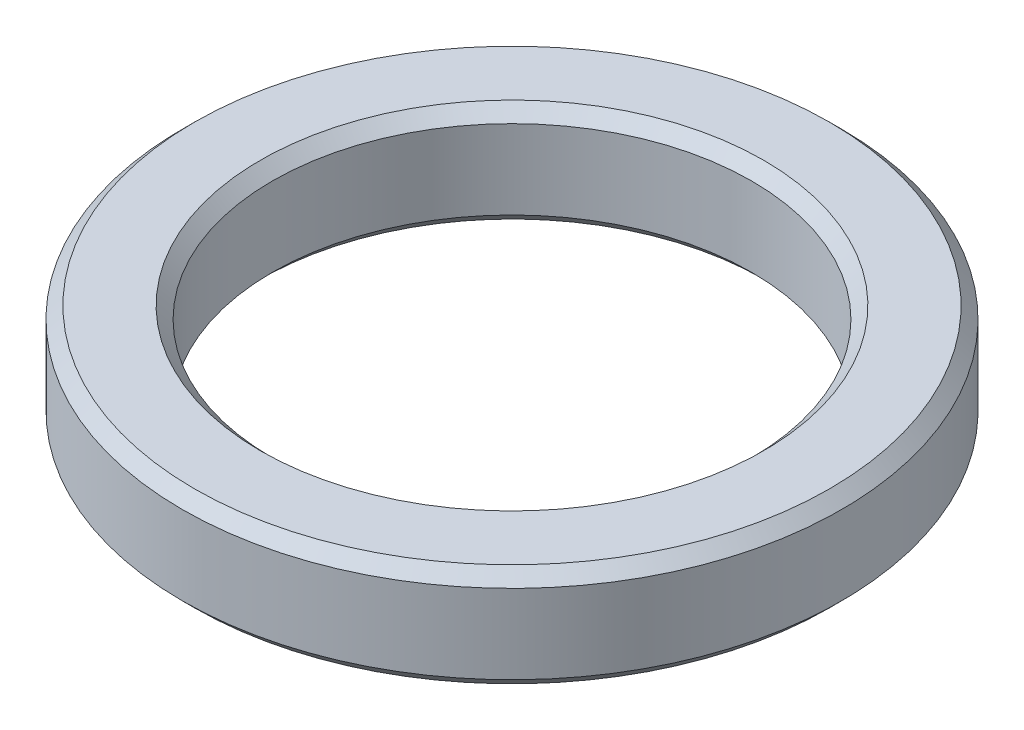
ISO-10303-21;
HEADER;
FILE_DESCRIPTION(('STEP AP214'),'2;1');
FILE_NAME('part.step','',(''),(''),'','','');
FILE_SCHEMA(('AUTOMOTIVE_DESIGN { 1 0 10303 214 1 1 1 1 }'));
ENDSEC;
DATA;
#1=APPLICATION_CONTEXT('core data for automotive mechanical design processes');
#2=APPLICATION_PROTOCOL_DEFINITION('international standard','automotive_design',2000,#1);
#3=PRODUCT_CONTEXT('',#1,'mechanical');
#4=PRODUCT('Part','Part','',(#3));
#5=PRODUCT_RELATED_PRODUCT_CATEGORY('part','',(#4));
#6=PRODUCT_DEFINITION_FORMATION('','',#4);
#7=PRODUCT_DEFINITION_CONTEXT('part definition',#1,'design');
#8=PRODUCT_DEFINITION('design','',#6,#7);
#9=PRODUCT_DEFINITION_SHAPE('','',#8);
#10=(LENGTH_UNIT() NAMED_UNIT(*) SI_UNIT(.MILLI.,.METRE.));
#11=(NAMED_UNIT(*) PLANE_ANGLE_UNIT() SI_UNIT($,.RADIAN.));
#12=(NAMED_UNIT(*) SI_UNIT($,.STERADIAN.) SOLID_ANGLE_UNIT());
#13=UNCERTAINTY_MEASURE_WITH_UNIT(LENGTH_MEASURE(1.E-05),#10,'distance_accuracy_value','');
#14=(GEOMETRIC_REPRESENTATION_CONTEXT(3) GLOBAL_UNCERTAINTY_ASSIGNED_CONTEXT((#13)) GLOBAL_UNIT_ASSIGNED_CONTEXT((#10,
#11,#12)) REPRESENTATION_CONTEXT('',''));
#15=CARTESIAN_POINT('',(0.,0.,0.));
#16=DIRECTION('',(0.,0.,1.));
#17=DIRECTION('',(1.,0.,0.));
#18=AXIS2_PLACEMENT_3D('',#15,#16,#17);
#19=CARTESIAN_POINT('',(0.,0.86,0.));
#20=DIRECTION('',(0.,1.,0.));
#21=DIRECTION('',(0.,0.,1.));
#22=AXIS2_PLACEMENT_3D('',#19,#20,#21);
#23=PLANE('',#22);
#24=CARTESIAN_POINT('',(0.,0.86,0.));
#25=DIRECTION('',(0.,1.,0.));
#26=DIRECTION('',(0.,0.,1.));
#27=AXIS2_PLACEMENT_3D('',#24,#25,#26);
#28=CIRCLE('',#27,2.1);
#29=CARTESIAN_POINT('',(0.,0.86,2.1));
#30=VERTEX_POINT('',#29);
#31=EDGE_CURVE('E10',#30,#30,#28,.F.);
#32=ORIENTED_EDGE('',*,*,#31,.T.);
#33=EDGE_LOOP('',(#32));
#34=FACE_BOUND('',#33,.T.);
#35=CARTESIAN_POINT('',(0.,0.86,0.));
#36=DIRECTION('',(0.,1.,0.));
#37=DIRECTION('',(0.,0.,1.));
#38=AXIS2_PLACEMENT_3D('',#35,#36,#37);
#39=CIRCLE('',#38,2.65);
#40=CARTESIAN_POINT('',(0.,0.86,2.65));
#41=VERTEX_POINT('',#40);
#42=EDGE_CURVE('E39',#41,#41,#39,.T.);
#43=ORIENTED_EDGE('',*,*,#42,.T.);
#44=EDGE_LOOP('',(#43));
#45=FACE_BOUND('',#44,.T.);
#46=ADVANCED_FACE('F32',(#34,#45),#23,.T.);
#47=CARTESIAN_POINT('',(0.,0.,0.));
#48=DIRECTION('',(0.,1.,0.));
#49=DIRECTION('',(0.,0.,1.));
#50=AXIS2_PLACEMENT_3D('',#47,#48,#49);
#51=PLANE('',#50);
#52=CARTESIAN_POINT('',(0.,0.,0.));
#53=DIRECTION('',(0.,1.,0.));
#54=DIRECTION('',(0.,0.,1.));
#55=AXIS2_PLACEMENT_3D('',#52,#53,#54);
#56=CIRCLE('',#55,2.1);
#57=CARTESIAN_POINT('',(0.,0.,2.1));
#58=VERTEX_POINT('',#57);
#59=EDGE_CURVE('E58',#58,#58,#56,.T.);
#60=ORIENTED_EDGE('',*,*,#59,.T.);
#61=EDGE_LOOP('',(#60));
#62=FACE_BOUND('',#61,.T.);
#63=CARTESIAN_POINT('',(0.,0.,0.));
#64=DIRECTION('',(0.,1.,0.));
#65=DIRECTION('',(0.,0.,1.));
#66=AXIS2_PLACEMENT_3D('',#63,#64,#65);
#67=CIRCLE('',#66,2.65);
#68=CARTESIAN_POINT('',(0.,0.,2.65));
#69=VERTEX_POINT('',#68);
#70=EDGE_CURVE('E61',#69,#69,#67,.F.);
#71=ORIENTED_EDGE('',*,*,#70,.T.);
#72=EDGE_LOOP('',(#71));
#73=FACE_BOUND('',#72,.T.);
#74=ADVANCED_FACE('F65',(#62,#73),#51,.F.);
#75=CARTESIAN_POINT('',(0.,0.86,0.));
#76=DIRECTION('',(0.,-1.,0.));
#77=DIRECTION('',(0.,0.,-1.));
#78=AXIS2_PLACEMENT_3D('',#75,#76,#77);
#79=CYLINDRICAL_SURFACE('',#78,2.75);
#80=CARTESIAN_POINT('',(0.,0.099999999999999,0.));
#81=DIRECTION('',(0.,1.,0.));
#82=DIRECTION('',(0.,0.,1.));
#83=AXIS2_PLACEMENT_3D('',#80,#81,#82);
#84=CIRCLE('',#83,2.75);
#85=CARTESIAN_POINT('',(0.,0.099999999999999,2.75));
#86=VERTEX_POINT('',#85);
#87=EDGE_CURVE('E43',#86,#86,#84,.T.);
#88=ORIENTED_EDGE('',*,*,#87,.T.);
#89=EDGE_LOOP('',(#88));
#90=FACE_BOUND('',#89,.T.);
#91=CARTESIAN_POINT('',(0.,0.76,0.));
#92=DIRECTION('',(0.,1.,0.));
#93=DIRECTION('',(0.,0.,1.));
#94=AXIS2_PLACEMENT_3D('',#91,#92,#93);
#95=CIRCLE('',#94,2.75);
#96=CARTESIAN_POINT('',(0.,0.76,2.75));
#97=VERTEX_POINT('',#96);
#98=EDGE_CURVE('E47',#97,#97,#95,.F.);
#99=ORIENTED_EDGE('',*,*,#98,.T.);
#100=EDGE_LOOP('',(#99));
#101=FACE_BOUND('',#100,.T.);
#102=ADVANCED_FACE('F75',(#90,#101),#79,.T.);
#103=CARTESIAN_POINT('',(0.,0.86,0.));
#104=DIRECTION('',(0.,-1.,0.));
#105=DIRECTION('',(0.,0.,-1.));
#106=AXIS2_PLACEMENT_3D('',#103,#104,#105);
#107=CYLINDRICAL_SURFACE('',#106,2.);
#108=CARTESIAN_POINT('',(0.,0.099999999999999,0.));
#109=DIRECTION('',(0.,1.,0.));
#110=DIRECTION('',(0.,0.,1.));
#111=AXIS2_PLACEMENT_3D('',#108,#109,#110);
#112=CIRCLE('',#111,2.);
#113=CARTESIAN_POINT('',(0.,0.099999999999999,2.));
#114=VERTEX_POINT('',#113);
#115=EDGE_CURVE('E52',#114,#114,#112,.F.);
#116=ORIENTED_EDGE('',*,*,#115,.T.);
#117=EDGE_LOOP('',(#116));
#118=FACE_BOUND('',#117,.T.);
#119=CARTESIAN_POINT('',(0.,0.760000000000001,0.));
#120=DIRECTION('',(0.,1.,0.));
#121=DIRECTION('',(0.,0.,1.));
#122=AXIS2_PLACEMENT_3D('',#119,#120,#121);
#123=CIRCLE('',#122,2.);
#124=CARTESIAN_POINT('',(0.,0.760000000000001,2.));
#125=VERTEX_POINT('',#124);
#126=EDGE_CURVE('E55',#125,#125,#123,.T.);
#127=ORIENTED_EDGE('',*,*,#126,.T.);
#128=EDGE_LOOP('',(#127));
#129=FACE_BOUND('',#128,.T.);
#130=ADVANCED_FACE('F78',(#118,#129),#107,.F.);
#131=CARTESIAN_POINT('',(0.,0.,0.));
#132=DIRECTION('',(0.,-1.,0.));
#133=DIRECTION('',(0.,0.,-1.));
#134=AXIS2_PLACEMENT_3D('',#131,#132,#133);
#135=CONICAL_SURFACE('',#134,2.1,0.785398163397448);
#136=ORIENTED_EDGE('',*,*,#115,.F.);
#137=EDGE_LOOP('',(#136));
#138=FACE_BOUND('',#137,.T.);
#139=ORIENTED_EDGE('',*,*,#59,.F.);
#140=EDGE_LOOP('',(#139));
#141=FACE_BOUND('',#140,.T.);
#142=ADVANCED_FACE('F71',(#138,#141),#135,.F.);
#143=CARTESIAN_POINT('',(0.,0.099999999999999,0.));
#144=DIRECTION('',(0.,1.,0.));
#145=DIRECTION('',(0.,0.,1.));
#146=AXIS2_PLACEMENT_3D('',#143,#144,#145);
#147=CONICAL_SURFACE('',#146,2.75,0.78539816339745);
#148=ORIENTED_EDGE('',*,*,#70,.F.);
#149=EDGE_LOOP('',(#148));
#150=FACE_BOUND('',#149,.T.);
#151=ORIENTED_EDGE('',*,*,#87,.F.);
#152=EDGE_LOOP('',(#151));
#153=FACE_BOUND('',#152,.T.);
#154=ADVANCED_FACE('F67',(#150,#153),#147,.T.);
#155=CARTESIAN_POINT('',(0.,0.760000000000001,0.));
#156=DIRECTION('',(0.,1.,0.));
#157=DIRECTION('',(0.,0.,1.));
#158=AXIS2_PLACEMENT_3D('',#155,#156,#157);
#159=CONICAL_SURFACE('',#158,2.,0.785398163397448);
#160=ORIENTED_EDGE('',*,*,#31,.F.);
#161=EDGE_LOOP('',(#160));
#162=FACE_BOUND('',#161,.T.);
#163=ORIENTED_EDGE('',*,*,#126,.F.);
#164=EDGE_LOOP('',(#163));
#165=FACE_BOUND('',#164,.T.);
#166=ADVANCED_FACE('F70',(#162,#165),#159,.F.);
#167=CARTESIAN_POINT('',(0.,0.86,0.));
#168=DIRECTION('',(0.,-1.,0.));
#169=DIRECTION('',(0.,0.,-1.));
#170=AXIS2_PLACEMENT_3D('',#167,#168,#169);
#171=CONICAL_SURFACE('',#170,2.65,0.785398163397453);
#172=ORIENTED_EDGE('',*,*,#98,.F.);
#173=EDGE_LOOP('',(#172));
#174=FACE_BOUND('',#173,.T.);
#175=ORIENTED_EDGE('',*,*,#42,.F.);
#176=EDGE_LOOP('',(#175));
#177=FACE_BOUND('',#176,.T.);
#178=ADVANCED_FACE('F34',(#174,#177),#171,.T.);
#179=CLOSED_SHELL('',(#46,#74,#102,#130,#142,#154,#166,#178));
#180=MANIFOLD_SOLID_BREP('B2',#179);
#181=ADVANCED_BREP_SHAPE_REPRESENTATION('',(#18,#180),#14);
#182=SHAPE_DEFINITION_REPRESENTATION(#9,#181);
ENDSEC;
END-ISO-10303-21;
